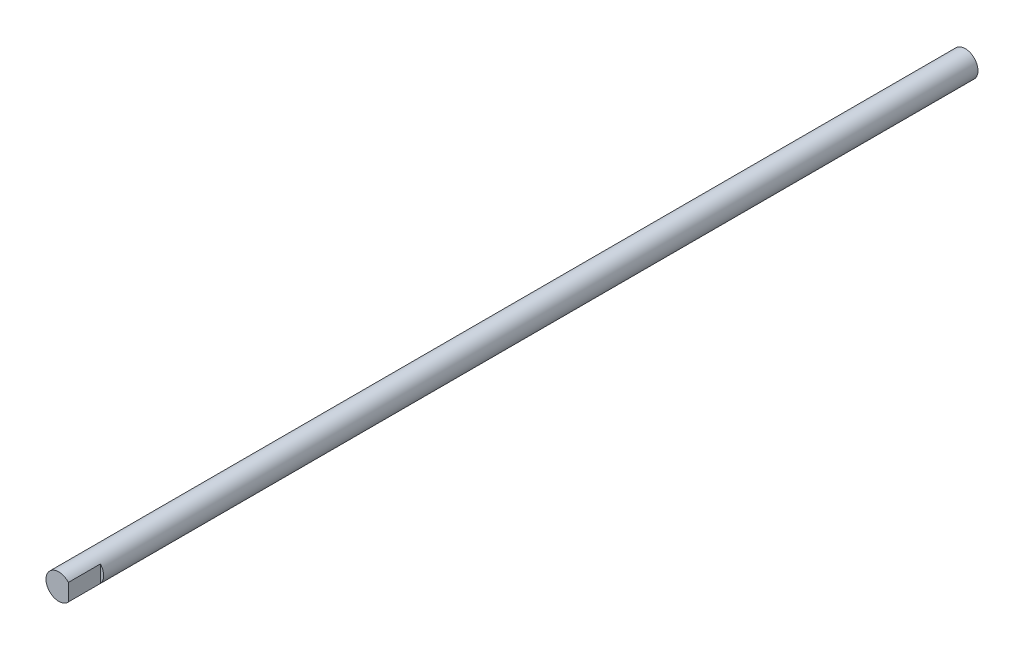
ISO-10303-21;
HEADER;
FILE_DESCRIPTION(('STEP AP214'),'2;1');
FILE_NAME('part.step','',(''),(''),'','','');
FILE_SCHEMA(('AUTOMOTIVE_DESIGN { 1 0 10303 214 1 1 1 1 }'));
ENDSEC;
DATA;
#1=APPLICATION_CONTEXT('core data for automotive mechanical design processes');
#2=APPLICATION_PROTOCOL_DEFINITION('international standard','automotive_design',2000,#1);
#3=PRODUCT_CONTEXT('',#1,'mechanical');
#4=PRODUCT('Part','Part','',(#3));
#5=PRODUCT_RELATED_PRODUCT_CATEGORY('part','',(#4));
#6=PRODUCT_DEFINITION_FORMATION('','',#4);
#7=PRODUCT_DEFINITION_CONTEXT('part definition',#1,'design');
#8=PRODUCT_DEFINITION('design','',#6,#7);
#9=PRODUCT_DEFINITION_SHAPE('','',#8);
#10=(LENGTH_UNIT() NAMED_UNIT(*) SI_UNIT(.MILLI.,.METRE.));
#11=(NAMED_UNIT(*) PLANE_ANGLE_UNIT() SI_UNIT($,.RADIAN.));
#12=(NAMED_UNIT(*) SI_UNIT($,.STERADIAN.) SOLID_ANGLE_UNIT());
#13=UNCERTAINTY_MEASURE_WITH_UNIT(LENGTH_MEASURE(1.E-05),#10,'distance_accuracy_value','');
#14=(GEOMETRIC_REPRESENTATION_CONTEXT(3) GLOBAL_UNCERTAINTY_ASSIGNED_CONTEXT((#13)) GLOBAL_UNIT_ASSIGNED_CONTEXT((#10,
#11,#12)) REPRESENTATION_CONTEXT('',''));
#15=CARTESIAN_POINT('',(0.,0.,0.));
#16=DIRECTION('',(0.,0.,1.));
#17=DIRECTION('',(1.,0.,0.));
#18=AXIS2_PLACEMENT_3D('',#15,#16,#17);
#19=CARTESIAN_POINT('',(0.,0.,-283.));
#20=DIRECTION('',(0.,0.,1.));
#21=DIRECTION('',(1.,0.,0.));
#22=AXIS2_PLACEMENT_3D('',#19,#20,#21);
#23=CYLINDRICAL_SURFACE('',#22,4.);
#24=DIRECTION('',(0.,0.,1.));
#25=VECTOR('',#24,1.);
#26=CARTESIAN_POINT('',(3.,-2.64575131106459,-283.));
#27=LINE('',#26,#25);
#28=CARTESIAN_POINT('',(3.,-2.64575131106459,0.));
#29=VERTEX_POINT('',#28);
#30=CARTESIAN_POINT('',(3.,-2.64575131106459,-10.));
#31=VERTEX_POINT('',#30);
#32=EDGE_CURVE('E52',#29,#31,#27,.F.);
#33=ORIENTED_EDGE('',*,*,#32,.F.);
#34=CARTESIAN_POINT('',(0.,0.,0.));
#35=DIRECTION('',(0.,0.,1.));
#36=DIRECTION('',(1.,0.,0.));
#37=AXIS2_PLACEMENT_3D('',#34,#35,#36);
#38=CIRCLE('',#37,4.);
#39=CARTESIAN_POINT('',(3.,2.64575131106459,0.));
#40=VERTEX_POINT('',#39);
#41=EDGE_CURVE('E65',#40,#29,#38,.T.);
#42=ORIENTED_EDGE('',*,*,#41,.F.);
#43=DIRECTION('',(0.,0.,1.));
#44=VECTOR('',#43,1.);
#45=CARTESIAN_POINT('',(3.,2.64575131106459,-283.));
#46=LINE('',#45,#44);
#47=CARTESIAN_POINT('',(3.,2.64575131106459,-10.));
#48=VERTEX_POINT('',#47);
#49=EDGE_CURVE('E47',#48,#40,#46,.T.);
#50=ORIENTED_EDGE('',*,*,#49,.F.);
#51=CARTESIAN_POINT('',(0.,0.,-10.));
#52=DIRECTION('',(0.,0.,1.));
#53=DIRECTION('',(1.,0.,0.));
#54=AXIS2_PLACEMENT_3D('',#51,#52,#53);
#55=CIRCLE('',#54,4.);
#56=EDGE_CURVE('E11',#48,#31,#55,.F.);
#57=ORIENTED_EDGE('',*,*,#56,.T.);
#58=EDGE_LOOP('',(#33,#42,#50,#57));
#59=FACE_BOUND('',#58,.T.);
#60=CARTESIAN_POINT('',(0.,0.,-283.));
#61=DIRECTION('',(0.,0.,1.));
#62=DIRECTION('',(1.,0.,0.));
#63=AXIS2_PLACEMENT_3D('',#60,#61,#62);
#64=CIRCLE('',#63,4.);
#65=CARTESIAN_POINT('',(4.,0.,-283.));
#66=VERTEX_POINT('',#65);
#67=EDGE_CURVE('E62',#66,#66,#64,.T.);
#68=ORIENTED_EDGE('',*,*,#67,.T.);
#69=EDGE_LOOP('',(#68));
#70=FACE_BOUND('',#69,.T.);
#71=ADVANCED_FACE('F33',(#59,#70),#23,.T.);
#72=CARTESIAN_POINT('',(0.,0.,-283.));
#73=DIRECTION('',(0.,0.,1.));
#74=DIRECTION('',(1.,0.,0.));
#75=AXIS2_PLACEMENT_3D('',#72,#73,#74);
#76=PLANE('',#75);
#77=ORIENTED_EDGE('',*,*,#67,.F.);
#78=EDGE_LOOP('',(#77));
#79=FACE_BOUND('',#78,.T.);
#80=ADVANCED_FACE('F83',(#79),#76,.F.);
#81=CARTESIAN_POINT('',(0.,0.,0.));
#82=DIRECTION('',(0.,0.,1.));
#83=DIRECTION('',(1.,0.,0.));
#84=AXIS2_PLACEMENT_3D('',#81,#82,#83);
#85=PLANE('',#84);
#86=DIRECTION('',(0.,-1.,0.));
#87=VECTOR('',#86,1.);
#88=CARTESIAN_POINT('',(3.,0.,0.));
#89=LINE('',#88,#87);
#90=EDGE_CURVE('E40',#40,#29,#89,.T.);
#91=ORIENTED_EDGE('',*,*,#90,.F.);
#92=ORIENTED_EDGE('',*,*,#41,.T.);
#93=EDGE_LOOP('',(#91,#92));
#94=FACE_BOUND('',#93,.T.);
#95=ADVANCED_FACE('F67',(#94),#85,.T.);
#96=CARTESIAN_POINT('',(3.,5.29683379802253,-10.));
#97=DIRECTION('',(-1.,0.,0.));
#98=DIRECTION('',(0.,-1.,0.));
#99=AXIS2_PLACEMENT_3D('',#96,#97,#98);
#100=PLANE('',#99);
#101=ORIENTED_EDGE('',*,*,#32,.T.);
#102=DIRECTION('',(0.,-1.,0.));
#103=VECTOR('',#102,1.);
#104=CARTESIAN_POINT('',(3.,5.29683379802253,-10.));
#105=LINE('',#104,#103);
#106=EDGE_CURVE('E73',#48,#31,#105,.T.);
#107=ORIENTED_EDGE('',*,*,#106,.F.);
#108=ORIENTED_EDGE('',*,*,#49,.T.);
#109=ORIENTED_EDGE('',*,*,#90,.T.);
#110=EDGE_LOOP('',(#101,#107,#108,#109));
#111=FACE_BOUND('',#110,.T.);
#112=ADVANCED_FACE('F58',(#111),#100,.F.);
#113=CARTESIAN_POINT('',(0.,0.,-10.));
#114=DIRECTION('',(0.,0.,1.));
#115=DIRECTION('',(1.,0.,0.));
#116=AXIS2_PLACEMENT_3D('',#113,#114,#115);
#117=PLANE('',#116);
#118=ORIENTED_EDGE('',*,*,#106,.T.);
#119=ORIENTED_EDGE('',*,*,#56,.F.);
#120=EDGE_LOOP('',(#118,#119));
#121=FACE_BOUND('',#120,.T.);
#122=ADVANCED_FACE('F75',(#121),#117,.T.);
#123=CLOSED_SHELL('',(#71,#80,#95,#112,#122));
#124=MANIFOLD_SOLID_BREP('B2',#123);
#125=ADVANCED_BREP_SHAPE_REPRESENTATION('',(#18,#124),#14);
#126=SHAPE_DEFINITION_REPRESENTATION(#9,#125);
ENDSEC;
END-ISO-10303-21;
